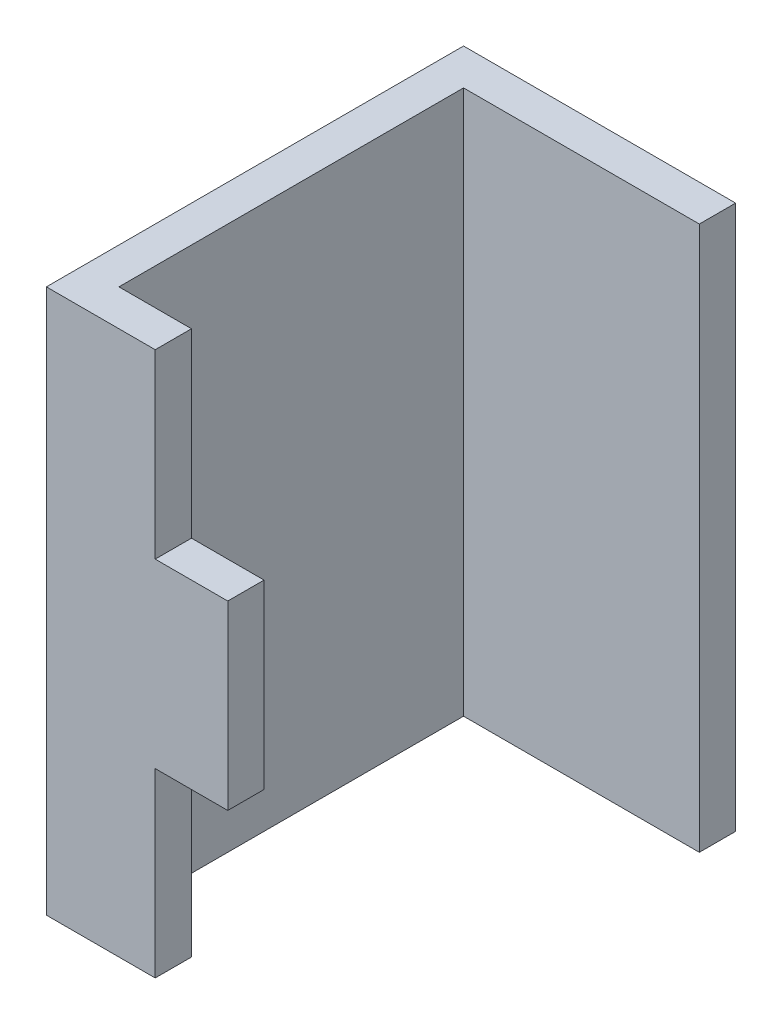
ISO-10303-21;
HEADER;
FILE_DESCRIPTION(('STEP AP214'),'2;1');
FILE_NAME('part.step','',(''),(''),'','','');
FILE_SCHEMA(('AUTOMOTIVE_DESIGN { 1 0 10303 214 1 1 1 1 }'));
ENDSEC;
DATA;
#1=APPLICATION_CONTEXT('core data for automotive mechanical design processes');
#2=APPLICATION_PROTOCOL_DEFINITION('international standard','automotive_design',2000,#1);
#3=PRODUCT_CONTEXT('',#1,'mechanical');
#4=PRODUCT('Part','Part','',(#3));
#5=PRODUCT_RELATED_PRODUCT_CATEGORY('part','',(#4));
#6=PRODUCT_DEFINITION_FORMATION('','',#4);
#7=PRODUCT_DEFINITION_CONTEXT('part definition',#1,'design');
#8=PRODUCT_DEFINITION('design','',#6,#7);
#9=PRODUCT_DEFINITION_SHAPE('','',#8);
#10=(LENGTH_UNIT() NAMED_UNIT(*) SI_UNIT(.MILLI.,.METRE.));
#11=(NAMED_UNIT(*) PLANE_ANGLE_UNIT() SI_UNIT($,.RADIAN.));
#12=(NAMED_UNIT(*) SI_UNIT($,.STERADIAN.) SOLID_ANGLE_UNIT());
#13=UNCERTAINTY_MEASURE_WITH_UNIT(LENGTH_MEASURE(1.E-05),#10,'distance_accuracy_value','');
#14=(GEOMETRIC_REPRESENTATION_CONTEXT(3) GLOBAL_UNCERTAINTY_ASSIGNED_CONTEXT((#13)) GLOBAL_UNIT_ASSIGNED_CONTEXT((#10,
#11,#12)) REPRESENTATION_CONTEXT('',''));
#15=CARTESIAN_POINT('',(0.,0.,0.));
#16=DIRECTION('',(0.,0.,1.));
#17=DIRECTION('',(1.,0.,0.));
#18=AXIS2_PLACEMENT_3D('',#15,#16,#17);
#19=CARTESIAN_POINT('',(10.4642,5.547770604355,1.00916));
#20=DIRECTION('',(0.,0.,-1.));
#21=DIRECTION('',(-1.,0.,0.));
#22=AXIS2_PLACEMENT_3D('',#19,#20,#21);
#23=PLANE('',#22);
#24=DIRECTION('',(0.,1.,0.));
#25=VECTOR('',#24,1.);
#26=CARTESIAN_POINT('',(10.4642,5.547770604355,1.00916));
#27=LINE('',#26,#25);
#28=CARTESIAN_POINT('',(10.4642,5.27318,1.00916));
#29=VERTEX_POINT('',#28);
#30=CARTESIAN_POINT('',(10.4642,4.97318,1.00916));
#31=VERTEX_POINT('',#30);
#32=EDGE_CURVE('E136',#29,#31,#27,.F.);
#33=ORIENTED_EDGE('',*,*,#32,.F.);
#34=DIRECTION('',(-1.,0.,0.));
#35=VECTOR('',#34,1.);
#36=CARTESIAN_POINT('',(10.4642,5.27318,1.00916));
#37=LINE('',#36,#35);
#38=CARTESIAN_POINT('',(10.5042,5.27318,1.00916));
#39=VERTEX_POINT('',#38);
#40=EDGE_CURVE('E144',#29,#39,#37,.F.);
#41=ORIENTED_EDGE('',*,*,#40,.T.);
#42=DIRECTION('',(0.,1.,0.));
#43=VECTOR('',#42,1.);
#44=CARTESIAN_POINT('',(10.5042,5.27318,1.00916));
#45=LINE('',#44,#43);
#46=CARTESIAN_POINT('',(10.5042,5.17318,1.00916));
#47=VERTEX_POINT('',#46);
#48=EDGE_CURVE('E116',#39,#47,#45,.F.);
#49=ORIENTED_EDGE('',*,*,#48,.T.);
#50=DIRECTION('',(-1.,0.,0.));
#51=VECTOR('',#50,1.);
#52=CARTESIAN_POINT('',(10.4642,5.17318,1.00916));
#53=LINE('',#52,#51);
#54=CARTESIAN_POINT('',(10.5442,5.17318,1.00916));
#55=VERTEX_POINT('',#54);
#56=EDGE_CURVE('E20',#47,#55,#53,.F.);
#57=ORIENTED_EDGE('',*,*,#56,.T.);
#58=DIRECTION('',(0.,1.,0.));
#59=VECTOR('',#58,1.);
#60=CARTESIAN_POINT('',(10.5442,5.547770604355,1.00916));
#61=LINE('',#60,#59);
#62=CARTESIAN_POINT('',(10.5442,5.07318,1.00916));
#63=VERTEX_POINT('',#62);
#64=EDGE_CURVE('E120',#63,#55,#61,.T.);
#65=ORIENTED_EDGE('',*,*,#64,.F.);
#66=DIRECTION('',(1.,0.,0.));
#67=VECTOR('',#66,1.);
#68=CARTESIAN_POINT('',(10.5042,5.07318,1.00916));
#69=LINE('',#68,#67);
#70=CARTESIAN_POINT('',(10.5042,5.07318,1.00916));
#71=VERTEX_POINT('',#70);
#72=EDGE_CURVE('E103',#63,#71,#69,.F.);
#73=ORIENTED_EDGE('',*,*,#72,.T.);
#74=DIRECTION('',(0.,1.,0.));
#75=VECTOR('',#74,1.);
#76=CARTESIAN_POINT('',(10.5042,4.97318,1.00916));
#77=LINE('',#76,#75);
#78=CARTESIAN_POINT('',(10.5042,4.97318,1.00916));
#79=VERTEX_POINT('',#78);
#80=EDGE_CURVE('E109',#71,#79,#77,.F.);
#81=ORIENTED_EDGE('',*,*,#80,.T.);
#82=DIRECTION('',(-1.,0.,0.));
#83=VECTOR('',#82,1.);
#84=CARTESIAN_POINT('',(10.4642,4.97318,1.00916));
#85=LINE('',#84,#83);
#86=EDGE_CURVE('E145',#79,#31,#85,.T.);
#87=ORIENTED_EDGE('',*,*,#86,.T.);
#88=EDGE_LOOP('',(#33,#41,#49,#57,#65,#73,#81,#87));
#89=FACE_BOUND('',#88,.T.);
#90=ADVANCED_FACE('F17',(#89),#23,.T.);
#91=CARTESIAN_POINT('',(10.5942,5.547770604355,0.79916));
#92=DIRECTION('',(1.,0.,0.));
#93=DIRECTION('',(0.,0.,-1.));
#94=AXIS2_PLACEMENT_3D('',#91,#92,#93);
#95=PLANE('',#94);
#96=DIRECTION('',(0.,0.,-1.));
#97=VECTOR('',#96,1.);
#98=CARTESIAN_POINT('',(10.5942,4.97318,0.79916));
#99=LINE('',#98,#97);
#100=CARTESIAN_POINT('',(10.5942,4.97318,0.81916));
#101=VERTEX_POINT('',#100);
#102=CARTESIAN_POINT('',(10.5942,4.97318,0.79916));
#103=VERTEX_POINT('',#102);
#104=EDGE_CURVE('E142',#101,#103,#99,.T.);
#105=ORIENTED_EDGE('',*,*,#104,.T.);
#106=DIRECTION('',(0.,1.,0.));
#107=VECTOR('',#106,1.);
#108=CARTESIAN_POINT('',(10.5942,5.547770604355,0.79916));
#109=LINE('',#108,#107);
#110=CARTESIAN_POINT('',(10.5942,5.27318,0.79916));
#111=VERTEX_POINT('',#110);
#112=EDGE_CURVE('E177',#111,#103,#109,.F.);
#113=ORIENTED_EDGE('',*,*,#112,.F.);
#114=DIRECTION('',(0.,0.,-1.));
#115=VECTOR('',#114,1.);
#116=CARTESIAN_POINT('',(10.5942,5.27318,1.00916));
#117=LINE('',#116,#115);
#118=CARTESIAN_POINT('',(10.5942,5.27318,0.81916));
#119=VERTEX_POINT('',#118);
#120=EDGE_CURVE('E163',#111,#119,#117,.F.);
#121=ORIENTED_EDGE('',*,*,#120,.T.);
#122=DIRECTION('',(0.,-1.,0.));
#123=VECTOR('',#122,1.);
#124=CARTESIAN_POINT('',(10.5942,5.547770604355,0.81916));
#125=LINE('',#124,#123);
#126=EDGE_CURVE('E139',#101,#119,#125,.F.);
#127=ORIENTED_EDGE('',*,*,#126,.F.);
#128=EDGE_LOOP('',(#105,#113,#121,#127));
#129=FACE_BOUND('',#128,.T.);
#130=ADVANCED_FACE('F219',(#129),#95,.T.);
#131=CARTESIAN_POINT('',(10.5942,5.547770604355,0.81916));
#132=DIRECTION('',(0.,0.,1.));
#133=DIRECTION('',(0.,-1.,0.));
#134=AXIS2_PLACEMENT_3D('',#131,#132,#133);
#135=PLANE('',#134);
#136=DIRECTION('',(1.,0.,0.));
#137=VECTOR('',#136,1.);
#138=CARTESIAN_POINT('',(10.7442,4.97318,0.81916));
#139=LINE('',#138,#137);
#140=CARTESIAN_POINT('',(10.4642,4.97318,0.81916));
#141=VERTEX_POINT('',#140);
#142=EDGE_CURVE('E184',#101,#141,#139,.F.);
#143=ORIENTED_EDGE('',*,*,#142,.F.);
#144=ORIENTED_EDGE('',*,*,#126,.T.);
#145=DIRECTION('',(1.,0.,0.));
#146=VECTOR('',#145,1.);
#147=CARTESIAN_POINT('',(11.0242,5.27318,0.81916));
#148=LINE('',#147,#146);
#149=CARTESIAN_POINT('',(10.4642,5.27318,0.81916));
#150=VERTEX_POINT('',#149);
#151=EDGE_CURVE('E167',#119,#150,#148,.F.);
#152=ORIENTED_EDGE('',*,*,#151,.T.);
#153=DIRECTION('',(0.,1.,0.));
#154=VECTOR('',#153,1.);
#155=CARTESIAN_POINT('',(10.4642,5.547770604355,0.81916));
#156=LINE('',#155,#154);
#157=EDGE_CURVE('E133',#141,#150,#156,.T.);
#158=ORIENTED_EDGE('',*,*,#157,.F.);
#159=EDGE_LOOP('',(#143,#144,#152,#158));
#160=FACE_BOUND('',#159,.T.);
#161=ADVANCED_FACE('F223',(#160),#135,.T.);
#162=CARTESIAN_POINT('',(10.4642,5.547770604355,0.81916));
#163=DIRECTION('',(1.,0.,0.));
#164=DIRECTION('',(0.,0.,-1.));
#165=AXIS2_PLACEMENT_3D('',#162,#163,#164);
#166=PLANE('',#165);
#167=DIRECTION('',(0.,0.,-1.));
#168=VECTOR('',#167,1.);
#169=CARTESIAN_POINT('',(10.4642,4.97318,0.81916));
#170=LINE('',#169,#168);
#171=EDGE_CURVE('E187',#141,#31,#170,.F.);
#172=ORIENTED_EDGE('',*,*,#171,.F.);
#173=ORIENTED_EDGE('',*,*,#157,.T.);
#174=DIRECTION('',(0.,0.,-1.));
#175=VECTOR('',#174,1.);
#176=CARTESIAN_POINT('',(10.4642,5.27318,1.00916));
#177=LINE('',#176,#175);
#178=EDGE_CURVE('E169',#150,#29,#177,.F.);
#179=ORIENTED_EDGE('',*,*,#178,.T.);
#180=ORIENTED_EDGE('',*,*,#32,.T.);
#181=EDGE_LOOP('',(#172,#173,#179,#180));
#182=FACE_BOUND('',#181,.T.);
#183=ADVANCED_FACE('F226',(#182),#166,.T.);
#184=CARTESIAN_POINT('',(10.5042,5.27318,0.901456703857));
#185=DIRECTION('',(-1.,0.,0.));
#186=DIRECTION('',(0.,0.,1.));
#187=AXIS2_PLACEMENT_3D('',#184,#185,#186);
#188=PLANE('',#187);
#189=DIRECTION('',(0.,0.,-1.));
#190=VECTOR('',#189,1.);
#191=CARTESIAN_POINT('',(10.5042,5.27318,1.00916));
#192=LINE('',#191,#190);
#193=CARTESIAN_POINT('',(10.5042,5.27318,1.02916));
#194=VERTEX_POINT('',#193);
#195=EDGE_CURVE('E172',#39,#194,#192,.F.);
#196=ORIENTED_EDGE('',*,*,#195,.T.);
#197=DIRECTION('',(0.,-1.,0.));
#198=VECTOR('',#197,1.);
#199=CARTESIAN_POINT('',(10.5042,5.547770604355,1.02916));
#200=LINE('',#199,#198);
#201=CARTESIAN_POINT('',(10.5042,5.17318,1.02916));
#202=VERTEX_POINT('',#201);
#203=EDGE_CURVE('E190',#202,#194,#200,.F.);
#204=ORIENTED_EDGE('',*,*,#203,.F.);
#205=DIRECTION('',(0.,0.,-1.));
#206=VECTOR('',#205,1.);
#207=CARTESIAN_POINT('',(10.5042,5.17318,0.901456703857));
#208=LINE('',#207,#206);
#209=EDGE_CURVE('E161',#202,#47,#208,.T.);
#210=ORIENTED_EDGE('',*,*,#209,.T.);
#211=ORIENTED_EDGE('',*,*,#48,.F.);
#212=EDGE_LOOP('',(#196,#204,#210,#211));
#213=FACE_BOUND('',#212,.T.);
#214=ADVANCED_FACE('F231',(#213),#188,.F.);
#215=CARTESIAN_POINT('',(10.5042,4.97318,0.901456703857));
#216=DIRECTION('',(-1.,0.,0.));
#217=DIRECTION('',(0.,0.,1.));
#218=AXIS2_PLACEMENT_3D('',#215,#216,#217);
#219=PLANE('',#218);
#220=DIRECTION('',(0.,0.,1.));
#221=VECTOR('',#220,1.);
#222=CARTESIAN_POINT('',(10.5042,5.07318,0.901456703857));
#223=LINE('',#222,#221);
#224=CARTESIAN_POINT('',(10.5042,5.07318,1.02916));
#225=VERTEX_POINT('',#224);
#226=EDGE_CURVE('E112',#71,#225,#223,.T.);
#227=ORIENTED_EDGE('',*,*,#226,.T.);
#228=DIRECTION('',(0.,-1.,0.));
#229=VECTOR('',#228,1.);
#230=CARTESIAN_POINT('',(10.5042,5.547770604355,1.02916));
#231=LINE('',#230,#229);
#232=CARTESIAN_POINT('',(10.5042,4.97318,1.02916));
#233=VERTEX_POINT('',#232);
#234=EDGE_CURVE('E197',#233,#225,#231,.F.);
#235=ORIENTED_EDGE('',*,*,#234,.F.);
#236=DIRECTION('',(0.,0.,-1.));
#237=VECTOR('',#236,1.);
#238=CARTESIAN_POINT('',(10.5042,4.97318,0.81916));
#239=LINE('',#238,#237);
#240=EDGE_CURVE('E114',#79,#233,#239,.F.);
#241=ORIENTED_EDGE('',*,*,#240,.F.);
#242=ORIENTED_EDGE('',*,*,#80,.F.);
#243=EDGE_LOOP('',(#227,#235,#241,#242));
#244=FACE_BOUND('',#243,.T.);
#245=ADVANCED_FACE('F110',(#244),#219,.F.);
#246=CARTESIAN_POINT('',(10.5042,5.07318,0.901456703857));
#247=DIRECTION('',(0.,1.,0.));
#248=DIRECTION('',(0.,0.,1.));
#249=AXIS2_PLACEMENT_3D('',#246,#247,#248);
#250=PLANE('',#249);
#251=DIRECTION('',(0.,0.,-1.));
#252=VECTOR('',#251,1.);
#253=CARTESIAN_POINT('',(10.5442,5.07318,1.00916));
#254=LINE('',#253,#252);
#255=CARTESIAN_POINT('',(10.5442,5.07318,1.02916));
#256=VERTEX_POINT('',#255);
#257=EDGE_CURVE('E122',#256,#63,#254,.T.);
#258=ORIENTED_EDGE('',*,*,#257,.F.);
#259=DIRECTION('',(1.,0.,0.));
#260=VECTOR('',#259,1.);
#261=CARTESIAN_POINT('',(10.5442,5.07318,1.02916));
#262=LINE('',#261,#260);
#263=EDGE_CURVE('E126',#225,#256,#262,.T.);
#264=ORIENTED_EDGE('',*,*,#263,.F.);
#265=ORIENTED_EDGE('',*,*,#226,.F.);
#266=ORIENTED_EDGE('',*,*,#72,.F.);
#267=EDGE_LOOP('',(#258,#264,#265,#266));
#268=FACE_BOUND('',#267,.T.);
#269=ADVANCED_FACE('F124',(#268),#250,.F.);
#270=CARTESIAN_POINT('',(10.5442,5.547770604355,1.00916));
#271=DIRECTION('',(1.,0.,0.));
#272=DIRECTION('',(0.,0.,-1.));
#273=AXIS2_PLACEMENT_3D('',#270,#271,#272);
#274=PLANE('',#273);
#275=ORIENTED_EDGE('',*,*,#257,.T.);
#276=ORIENTED_EDGE('',*,*,#64,.T.);
#277=DIRECTION('',(0.,0.,-1.));
#278=VECTOR('',#277,1.);
#279=CARTESIAN_POINT('',(10.5442,5.17318,0.901456703857));
#280=LINE('',#279,#278);
#281=CARTESIAN_POINT('',(10.5442,5.17318,1.02916));
#282=VERTEX_POINT('',#281);
#283=EDGE_CURVE('E154',#55,#282,#280,.F.);
#284=ORIENTED_EDGE('',*,*,#283,.T.);
#285=DIRECTION('',(0.,-1.,0.));
#286=VECTOR('',#285,1.);
#287=CARTESIAN_POINT('',(10.5442,5.547770604355,1.02916));
#288=LINE('',#287,#286);
#289=EDGE_CURVE('E200',#256,#282,#288,.F.);
#290=ORIENTED_EDGE('',*,*,#289,.F.);
#291=EDGE_LOOP('',(#275,#276,#284,#290));
#292=FACE_BOUND('',#291,.T.);
#293=ADVANCED_FACE('F152',(#292),#274,.T.);
#294=CARTESIAN_POINT('',(10.5042,5.17318,0.901456703857));
#295=DIRECTION('',(0.,-1.,0.));
#296=DIRECTION('',(0.,0.,-1.));
#297=AXIS2_PLACEMENT_3D('',#294,#295,#296);
#298=PLANE('',#297);
#299=ORIENTED_EDGE('',*,*,#209,.F.);
#300=DIRECTION('',(1.,0.,0.));
#301=VECTOR('',#300,1.);
#302=CARTESIAN_POINT('',(10.5442,5.17318,1.02916));
#303=LINE('',#302,#301);
#304=EDGE_CURVE('E159',#282,#202,#303,.F.);
#305=ORIENTED_EDGE('',*,*,#304,.F.);
#306=ORIENTED_EDGE('',*,*,#283,.F.);
#307=ORIENTED_EDGE('',*,*,#56,.F.);
#308=EDGE_LOOP('',(#299,#305,#306,#307));
#309=FACE_BOUND('',#308,.T.);
#310=ADVANCED_FACE('F157',(#309),#298,.F.);
#311=CARTESIAN_POINT('',(11.0242,5.27318,1.00916));
#312=DIRECTION('',(0.,-1.,0.));
#313=DIRECTION('',(0.,0.,-1.));
#314=AXIS2_PLACEMENT_3D('',#311,#312,#313);
#315=PLANE('',#314);
#316=ORIENTED_EDGE('',*,*,#195,.F.);
#317=ORIENTED_EDGE('',*,*,#40,.F.);
#318=ORIENTED_EDGE('',*,*,#178,.F.);
#319=ORIENTED_EDGE('',*,*,#151,.F.);
#320=ORIENTED_EDGE('',*,*,#120,.F.);
#321=DIRECTION('',(-1.,0.,0.));
#322=VECTOR('',#321,1.);
#323=CARTESIAN_POINT('',(10.4442,5.27318,0.79916));
#324=LINE('',#323,#322);
#325=CARTESIAN_POINT('',(10.4442,5.27318,0.79916));
#326=VERTEX_POINT('',#325);
#327=EDGE_CURVE('E174',#326,#111,#324,.F.);
#328=ORIENTED_EDGE('',*,*,#327,.F.);
#329=DIRECTION('',(0.,0.,1.));
#330=VECTOR('',#329,1.);
#331=CARTESIAN_POINT('',(10.4442,5.27318,1.02916));
#332=LINE('',#331,#330);
#333=CARTESIAN_POINT('',(10.4442,5.27318,1.02916));
#334=VERTEX_POINT('',#333);
#335=EDGE_CURVE('E203',#334,#326,#332,.F.);
#336=ORIENTED_EDGE('',*,*,#335,.F.);
#337=DIRECTION('',(1.,0.,0.));
#338=VECTOR('',#337,1.);
#339=CARTESIAN_POINT('',(10.5442,5.27318,1.02916));
#340=LINE('',#339,#338);
#341=EDGE_CURVE('E193',#194,#334,#340,.F.);
#342=ORIENTED_EDGE('',*,*,#341,.F.);
#343=EDGE_LOOP('',(#316,#317,#318,#319,#320,#328,#336,#342));
#344=FACE_BOUND('',#343,.T.);
#345=ADVANCED_FACE('F233',(#344),#315,.F.);
#346=CARTESIAN_POINT('',(10.4442,5.547770604355,0.79916));
#347=DIRECTION('',(0.,0.,-1.));
#348=DIRECTION('',(-1.,0.,0.));
#349=AXIS2_PLACEMENT_3D('',#346,#347,#348);
#350=PLANE('',#349);
#351=DIRECTION('',(1.,0.,0.));
#352=VECTOR('',#351,1.);
#353=CARTESIAN_POINT('',(10.7442,4.97318,0.79916));
#354=LINE('',#353,#352);
#355=CARTESIAN_POINT('',(10.4442,4.97318,0.79916));
#356=VERTEX_POINT('',#355);
#357=EDGE_CURVE('E181',#356,#103,#354,.T.);
#358=ORIENTED_EDGE('',*,*,#357,.F.);
#359=DIRECTION('',(0.,1.,0.));
#360=VECTOR('',#359,1.);
#361=CARTESIAN_POINT('',(10.4442,5.547770604355,0.79916));
#362=LINE('',#361,#360);
#363=EDGE_CURVE('E206',#326,#356,#362,.F.);
#364=ORIENTED_EDGE('',*,*,#363,.F.);
#365=ORIENTED_EDGE('',*,*,#327,.T.);
#366=ORIENTED_EDGE('',*,*,#112,.T.);
#367=EDGE_LOOP('',(#358,#364,#365,#366));
#368=FACE_BOUND('',#367,.T.);
#369=ADVANCED_FACE('F216',(#368),#350,.T.);
#370=CARTESIAN_POINT('',(10.7442,4.97318,0.81916));
#371=DIRECTION('',(0.,-1.,0.));
#372=DIRECTION('',(0.,0.,-1.));
#373=AXIS2_PLACEMENT_3D('',#370,#371,#372);
#374=PLANE('',#373);
#375=ORIENTED_EDGE('',*,*,#171,.T.);
#376=ORIENTED_EDGE('',*,*,#86,.F.);
#377=ORIENTED_EDGE('',*,*,#240,.T.);
#378=DIRECTION('',(1.,0.,0.));
#379=VECTOR('',#378,1.);
#380=CARTESIAN_POINT('',(10.5442,4.97318,1.02916));
#381=LINE('',#380,#379);
#382=CARTESIAN_POINT('',(10.4442,4.97318,1.02916));
#383=VERTEX_POINT('',#382);
#384=EDGE_CURVE('E35',#383,#233,#381,.T.);
#385=ORIENTED_EDGE('',*,*,#384,.F.);
#386=DIRECTION('',(0.,0.,1.));
#387=VECTOR('',#386,1.);
#388=CARTESIAN_POINT('',(10.4442,4.97318,1.02916));
#389=LINE('',#388,#387);
#390=EDGE_CURVE('E26',#356,#383,#389,.T.);
#391=ORIENTED_EDGE('',*,*,#390,.F.);
#392=ORIENTED_EDGE('',*,*,#357,.T.);
#393=ORIENTED_EDGE('',*,*,#104,.F.);
#394=ORIENTED_EDGE('',*,*,#142,.T.);
#395=EDGE_LOOP('',(#375,#376,#377,#385,#391,#392,#393,#394));
#396=FACE_BOUND('',#395,.T.);
#397=ADVANCED_FACE('F213',(#396),#374,.T.);
#398=CARTESIAN_POINT('',(10.5442,5.547770604355,1.02916));
#399=DIRECTION('',(0.,0.,1.));
#400=DIRECTION('',(0.,-1.,0.));
#401=AXIS2_PLACEMENT_3D('',#398,#399,#400);
#402=PLANE('',#401);
#403=ORIENTED_EDGE('',*,*,#289,.T.);
#404=ORIENTED_EDGE('',*,*,#304,.T.);
#405=ORIENTED_EDGE('',*,*,#203,.T.);
#406=ORIENTED_EDGE('',*,*,#341,.T.);
#407=DIRECTION('',(0.,1.,0.));
#408=VECTOR('',#407,1.);
#409=CARTESIAN_POINT('',(10.4442,5.547770604355,1.02916));
#410=LINE('',#409,#408);
#411=EDGE_CURVE('E11',#383,#334,#410,.T.);
#412=ORIENTED_EDGE('',*,*,#411,.F.);
#413=ORIENTED_EDGE('',*,*,#384,.T.);
#414=ORIENTED_EDGE('',*,*,#234,.T.);
#415=ORIENTED_EDGE('',*,*,#263,.T.);
#416=EDGE_LOOP('',(#403,#404,#405,#406,#412,#413,#414,#415));
#417=FACE_BOUND('',#416,.T.);
#418=ADVANCED_FACE('F235',(#417),#402,.T.);
#419=CARTESIAN_POINT('',(10.4442,5.547770604355,1.02916));
#420=DIRECTION('',(-1.,0.,0.));
#421=DIRECTION('',(0.,0.,1.));
#422=AXIS2_PLACEMENT_3D('',#419,#420,#421);
#423=PLANE('',#422);
#424=ORIENTED_EDGE('',*,*,#390,.T.);
#425=ORIENTED_EDGE('',*,*,#411,.T.);
#426=ORIENTED_EDGE('',*,*,#335,.T.);
#427=ORIENTED_EDGE('',*,*,#363,.T.);
#428=EDGE_LOOP('',(#424,#425,#426,#427));
#429=FACE_BOUND('',#428,.T.);
#430=ADVANCED_FACE('F211',(#429),#423,.T.);
#431=CLOSED_SHELL('',(#90,#130,#161,#183,#214,#245,#269,#293,#310,#345,#369,#397,#418,#430));
#432=MANIFOLD_SOLID_BREP('B1',#431);
#433=ADVANCED_BREP_SHAPE_REPRESENTATION('',(#18,#432),#14);
#434=SHAPE_DEFINITION_REPRESENTATION(#9,#433);
ENDSEC;
END-ISO-10303-21;
